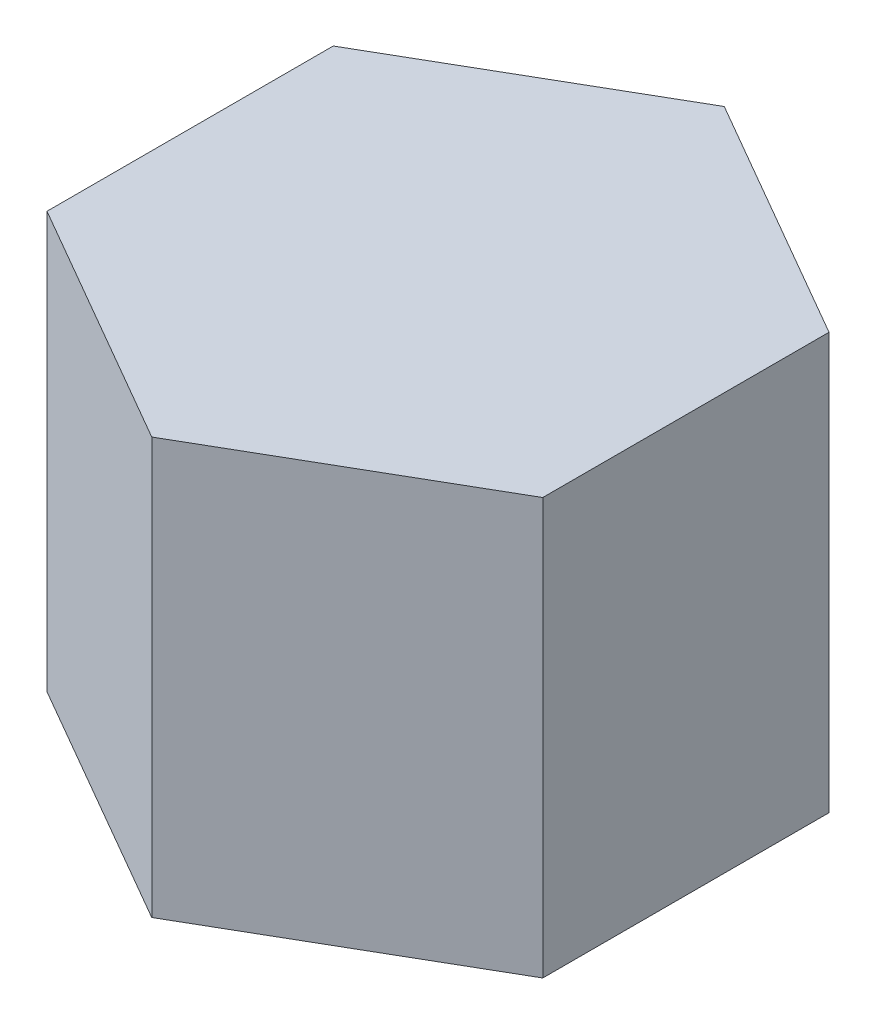
ISO-10303-21;
HEADER;
FILE_DESCRIPTION(('STEP AP214'),'2;1');
FILE_NAME('part.step','',(''),(''),'','','');
FILE_SCHEMA(('AUTOMOTIVE_DESIGN { 1 0 10303 214 1 1 1 1 }'));
ENDSEC;
DATA;
#1=APPLICATION_CONTEXT('core data for automotive mechanical design processes');
#2=APPLICATION_PROTOCOL_DEFINITION('international standard','automotive_design',2000,#1);
#3=PRODUCT_CONTEXT('',#1,'mechanical');
#4=PRODUCT('Part','Part','',(#3));
#5=PRODUCT_RELATED_PRODUCT_CATEGORY('part','',(#4));
#6=PRODUCT_DEFINITION_FORMATION('','',#4);
#7=PRODUCT_DEFINITION_CONTEXT('part definition',#1,'design');
#8=PRODUCT_DEFINITION('design','',#6,#7);
#9=PRODUCT_DEFINITION_SHAPE('','',#8);
#10=(LENGTH_UNIT() NAMED_UNIT(*) SI_UNIT(.MILLI.,.METRE.));
#11=(NAMED_UNIT(*) PLANE_ANGLE_UNIT() SI_UNIT($,.RADIAN.));
#12=(NAMED_UNIT(*) SI_UNIT($,.STERADIAN.) SOLID_ANGLE_UNIT());
#13=UNCERTAINTY_MEASURE_WITH_UNIT(LENGTH_MEASURE(1.E-05),#10,'distance_accuracy_value','');
#14=(GEOMETRIC_REPRESENTATION_CONTEXT(3) GLOBAL_UNCERTAINTY_ASSIGNED_CONTEXT((#13)) GLOBAL_UNIT_ASSIGNED_CONTEXT((#10,
#11,#12)) REPRESENTATION_CONTEXT('',''));
#15=CARTESIAN_POINT('',(0.,0.,0.));
#16=DIRECTION('',(0.,0.,1.));
#17=DIRECTION('',(1.,0.,0.));
#18=AXIS2_PLACEMENT_3D('',#15,#16,#17);
#19=CARTESIAN_POINT('',(205.339551417382,-147.556598747966,288.217869605357));
#20=DIRECTION('',(-0.499999999999943,0.,-0.866025403784471));
#21=DIRECTION('',(-0.866025403784471,0.,0.499999999999943));
#22=AXIS2_PLACEMENT_3D('',#19,#20,#21);
#23=PLANE('',#22);
#24=CARTESIAN_POINT('',(205.642660308706,-147.047793579175,288.042869605357));
#25=DIRECTION('',(-0.866025403784471,0.,0.499999999999943));
#26=VECTOR('',#25,1.);
#27=LINE('',#24,#26);
#28=CARTESIAN_POINT('',(205.642660308706,-147.047793579175,288.042869605357));
#29=VERTEX_POINT('',#28);
#30=CARTESIAN_POINT('',(205.339551417382,-147.047793579175,288.217869605357));
#31=VERTEX_POINT('',#30);
#32=EDGE_CURVE('E170',#29,#31,#27,.T.);
#33=ORIENTED_EDGE('',*,*,#32,.T.);
#34=CARTESIAN_POINT('',(205.339551417382,-147.556598747966,288.217869605357));
#35=DIRECTION('',(0.,1.,0.));
#36=VECTOR('',#35,1.);
#37=LINE('',#34,#36);
#38=CARTESIAN_POINT('',(205.339551417382,-147.556598747966,288.217869605357));
#39=VERTEX_POINT('',#38);
#40=EDGE_CURVE('E35',#39,#31,#37,.T.);
#41=ORIENTED_EDGE('',*,*,#40,.F.);
#42=CARTESIAN_POINT('',(205.642660308706,-147.556598747966,288.042869605357));
#43=DIRECTION('',(-0.866025403784471,0.,0.499999999999943));
#44=VECTOR('',#43,1.);
#45=LINE('',#42,#44);
#46=CARTESIAN_POINT('',(205.642660308706,-147.556598747966,288.042869605357));
#47=VERTEX_POINT('',#46);
#48=EDGE_CURVE('E159',#47,#39,#45,.T.);
#49=ORIENTED_EDGE('',*,*,#48,.F.);
#50=CARTESIAN_POINT('',(205.642660308706,-147.556598747966,288.042869605357));
#51=DIRECTION('',(0.,1.,0.));
#52=VECTOR('',#51,1.);
#53=LINE('',#50,#52);
#54=EDGE_CURVE('E10',#47,#29,#53,.T.);
#55=ORIENTED_EDGE('',*,*,#54,.T.);
#56=EDGE_LOOP('',(#33,#41,#49,#55));
#57=FACE_BOUND('',#56,.T.);
#58=ADVANCED_FACE('F16',(#57),#23,.F.);
#59=CARTESIAN_POINT('',(205.642660308706,-147.556598747966,291.594471220494));
#60=DIRECTION('',(-1.,0.,0.));
#61=DIRECTION('',(0.,-1.,0.));
#62=AXIS2_PLACEMENT_3D('',#59,#60,#61);
#63=PLANE('',#62);
#64=CARTESIAN_POINT('',(205.642660308706,-147.047793579175,287.692869605357));
#65=DIRECTION('',(0.,0.,1.));
#66=VECTOR('',#65,1.);
#67=LINE('',#64,#66);
#68=CARTESIAN_POINT('',(205.642660308706,-147.047793579175,287.692869605357));
#69=VERTEX_POINT('',#68);
#70=EDGE_CURVE('E167',#69,#29,#67,.T.);
#71=ORIENTED_EDGE('',*,*,#70,.T.);
#72=ORIENTED_EDGE('',*,*,#54,.F.);
#73=CARTESIAN_POINT('',(205.642660308706,-147.556598747966,287.692869605357));
#74=DIRECTION('',(0.,0.,1.));
#75=VECTOR('',#74,1.);
#76=LINE('',#73,#75);
#77=CARTESIAN_POINT('',(205.642660308706,-147.556598747966,287.692869605357));
#78=VERTEX_POINT('',#77);
#79=EDGE_CURVE('E156',#78,#47,#76,.T.);
#80=ORIENTED_EDGE('',*,*,#79,.F.);
#81=CARTESIAN_POINT('',(205.642660308706,-147.556598747966,287.692869605357));
#82=DIRECTION('',(0.,1.,0.));
#83=VECTOR('',#82,1.);
#84=LINE('',#81,#83);
#85=EDGE_CURVE('E27',#78,#69,#84,.T.);
#86=ORIENTED_EDGE('',*,*,#85,.T.);
#87=EDGE_LOOP('',(#71,#72,#80,#86));
#88=FACE_BOUND('',#87,.T.);
#89=ADVANCED_FACE('F189',(#88),#63,.F.);
#90=CARTESIAN_POINT('',(205.642660308706,-147.556598747966,287.692869605357));
#91=DIRECTION('',(-0.499999999999943,0.,0.866025403784471));
#92=DIRECTION('',(0.866025403784471,0.,0.499999999999943));
#93=AXIS2_PLACEMENT_3D('',#90,#91,#92);
#94=PLANE('',#93);
#95=CARTESIAN_POINT('',(205.339551417382,-147.047793579175,287.517869605357));
#96=DIRECTION('',(0.866025403784471,0.,0.499999999999943));
#97=VECTOR('',#96,1.);
#98=LINE('',#95,#97);
#99=CARTESIAN_POINT('',(205.339551417382,-147.047793579175,287.517869605357));
#100=VERTEX_POINT('',#99);
#101=EDGE_CURVE('E163',#100,#69,#98,.T.);
#102=ORIENTED_EDGE('',*,*,#101,.T.);
#103=ORIENTED_EDGE('',*,*,#85,.F.);
#104=CARTESIAN_POINT('',(205.339551417382,-147.556598747966,287.517869605357));
#105=DIRECTION('',(0.866025403784471,0.,0.499999999999943));
#106=VECTOR('',#105,1.);
#107=LINE('',#104,#106);
#108=CARTESIAN_POINT('',(205.339551417382,-147.556598747966,287.517869605357));
#109=VERTEX_POINT('',#108);
#110=EDGE_CURVE('E106',#109,#78,#107,.T.);
#111=ORIENTED_EDGE('',*,*,#110,.F.);
#112=CARTESIAN_POINT('',(205.339551417382,-147.556598747966,287.517869605357));
#113=DIRECTION('',(0.,1.,0.));
#114=VECTOR('',#113,1.);
#115=LINE('',#112,#114);
#116=EDGE_CURVE('E94',#109,#100,#115,.T.);
#117=ORIENTED_EDGE('',*,*,#116,.T.);
#118=EDGE_LOOP('',(#102,#103,#111,#117));
#119=FACE_BOUND('',#118,.T.);
#120=ADVANCED_FACE('F198',(#119),#94,.F.);
#121=CARTESIAN_POINT('',(205.339551417382,-147.556598747966,287.517869605357));
#122=DIRECTION('',(0.499999999999978,0.,0.866025403784452));
#123=DIRECTION('',(0.866025403784452,0.,-0.499999999999978));
#124=AXIS2_PLACEMENT_3D('',#121,#122,#123);
#125=PLANE('',#124);
#126=CARTESIAN_POINT('',(205.036442526057,-147.047793579175,287.692869605357));
#127=DIRECTION('',(0.866025403784452,0.,-0.499999999999978));
#128=VECTOR('',#127,1.);
#129=LINE('',#126,#128);
#130=CARTESIAN_POINT('',(205.036442526057,-147.047793579175,287.692869605357));
#131=VERTEX_POINT('',#130);
#132=EDGE_CURVE('E162',#131,#100,#129,.T.);
#133=ORIENTED_EDGE('',*,*,#132,.T.);
#134=ORIENTED_EDGE('',*,*,#116,.F.);
#135=CARTESIAN_POINT('',(205.036442526057,-147.556598747966,287.692869605357));
#136=DIRECTION('',(0.866025403784452,0.,-0.499999999999978));
#137=VECTOR('',#136,1.);
#138=LINE('',#135,#137);
#139=CARTESIAN_POINT('',(205.036442526057,-147.556598747966,287.692869605357));
#140=VERTEX_POINT('',#139);
#141=EDGE_CURVE('E98',#140,#109,#138,.T.);
#142=ORIENTED_EDGE('',*,*,#141,.F.);
#143=CARTESIAN_POINT('',(205.036442526057,-147.556598747966,287.692869605357));
#144=DIRECTION('',(0.,1.,0.));
#145=VECTOR('',#144,1.);
#146=LINE('',#143,#145);
#147=EDGE_CURVE('E79',#140,#131,#146,.T.);
#148=ORIENTED_EDGE('',*,*,#147,.T.);
#149=EDGE_LOOP('',(#133,#134,#142,#148));
#150=FACE_BOUND('',#149,.T.);
#151=ADVANCED_FACE('F100',(#150),#125,.F.);
#152=CARTESIAN_POINT('',(205.036442526057,-147.556598747966,291.594471220494));
#153=DIRECTION('',(1.,0.,0.));
#154=DIRECTION('',(0.,1.,0.));
#155=AXIS2_PLACEMENT_3D('',#152,#153,#154);
#156=PLANE('',#155);
#157=CARTESIAN_POINT('',(205.036442526057,-147.047793579175,288.042869605357));
#158=DIRECTION('',(0.,0.,-1.));
#159=VECTOR('',#158,1.);
#160=LINE('',#157,#159);
#161=CARTESIAN_POINT('',(205.036442526057,-147.047793579175,288.042869605357));
#162=VERTEX_POINT('',#161);
#163=EDGE_CURVE('E88',#162,#131,#160,.T.);
#164=ORIENTED_EDGE('',*,*,#163,.T.);
#165=ORIENTED_EDGE('',*,*,#147,.F.);
#166=CARTESIAN_POINT('',(205.036442526057,-147.556598747966,288.042869605357));
#167=DIRECTION('',(0.,0.,-1.));
#168=VECTOR('',#167,1.);
#169=LINE('',#166,#168);
#170=CARTESIAN_POINT('',(205.036442526057,-147.556598747966,288.042869605357));
#171=VERTEX_POINT('',#170);
#172=EDGE_CURVE('E84',#171,#140,#169,.T.);
#173=ORIENTED_EDGE('',*,*,#172,.F.);
#174=CARTESIAN_POINT('',(205.036442526057,-147.556598747966,288.042869605357));
#175=DIRECTION('',(0.,1.,0.));
#176=VECTOR('',#175,1.);
#177=LINE('',#174,#176);
#178=EDGE_CURVE('E58',#171,#162,#177,.T.);
#179=ORIENTED_EDGE('',*,*,#178,.T.);
#180=EDGE_LOOP('',(#164,#165,#173,#179));
#181=FACE_BOUND('',#180,.T.);
#182=ADVANCED_FACE('F82',(#181),#156,.F.);
#183=CARTESIAN_POINT('',(205.036442526057,-147.556598747966,288.042869605357));
#184=DIRECTION('',(0.499999999999943,0.,-0.866025403784471));
#185=DIRECTION('',(-0.866025403784471,0.,-0.499999999999943));
#186=AXIS2_PLACEMENT_3D('',#183,#184,#185);
#187=PLANE('',#186);
#188=CARTESIAN_POINT('',(205.339551417382,-147.047793579175,288.217869605357));
#189=DIRECTION('',(-0.866025403784471,0.,-0.499999999999943));
#190=VECTOR('',#189,1.);
#191=LINE('',#188,#190);
#192=EDGE_CURVE('E160',#31,#162,#191,.T.);
#193=ORIENTED_EDGE('',*,*,#192,.T.);
#194=ORIENTED_EDGE('',*,*,#178,.F.);
#195=CARTESIAN_POINT('',(205.339551417382,-147.556598747966,288.217869605357));
#196=DIRECTION('',(-0.866025403784471,0.,-0.499999999999943));
#197=VECTOR('',#196,1.);
#198=LINE('',#195,#197);
#199=EDGE_CURVE('E112',#39,#171,#198,.T.);
#200=ORIENTED_EDGE('',*,*,#199,.F.);
#201=ORIENTED_EDGE('',*,*,#40,.T.);
#202=EDGE_LOOP('',(#193,#194,#200,#201));
#203=FACE_BOUND('',#202,.T.);
#204=ADVANCED_FACE('F131',(#203),#187,.F.);
#205=CARTESIAN_POINT('',(206.491105863044,-147.556598747966,291.594471220494));
#206=DIRECTION('',(0.,1.,0.));
#207=DIRECTION('',(-1.,0.,0.));
#208=AXIS2_PLACEMENT_3D('',#205,#206,#207);
#209=PLANE('',#208);
#210=ORIENTED_EDGE('',*,*,#48,.T.);
#211=ORIENTED_EDGE('',*,*,#199,.T.);
#212=ORIENTED_EDGE('',*,*,#172,.T.);
#213=ORIENTED_EDGE('',*,*,#141,.T.);
#214=ORIENTED_EDGE('',*,*,#110,.T.);
#215=ORIENTED_EDGE('',*,*,#79,.T.);
#216=EDGE_LOOP('',(#210,#211,#212,#213,#214,#215));
#217=FACE_BOUND('',#216,.T.);
#218=ADVANCED_FACE('F111',(#217),#209,.F.);
#219=CARTESIAN_POINT('',(206.491105863044,-147.047793579175,291.594471220494));
#220=DIRECTION('',(0.,1.,0.));
#221=DIRECTION('',(-1.,0.,0.));
#222=AXIS2_PLACEMENT_3D('',#219,#220,#221);
#223=PLANE('',#222);
#224=ORIENTED_EDGE('',*,*,#32,.F.);
#225=ORIENTED_EDGE('',*,*,#70,.F.);
#226=ORIENTED_EDGE('',*,*,#101,.F.);
#227=ORIENTED_EDGE('',*,*,#132,.F.);
#228=ORIENTED_EDGE('',*,*,#163,.F.);
#229=ORIENTED_EDGE('',*,*,#192,.F.);
#230=EDGE_LOOP('',(#224,#225,#226,#227,#228,#229));
#231=FACE_BOUND('',#230,.T.);
#232=ADVANCED_FACE('F130',(#231),#223,.T.);
#233=CLOSED_SHELL('',(#58,#89,#120,#151,#182,#204,#218,#232));
#234=MANIFOLD_SOLID_BREP('B1',#233);
#235=ADVANCED_BREP_SHAPE_REPRESENTATION('',(#18,#234),#14);
#236=SHAPE_DEFINITION_REPRESENTATION(#9,#235);
ENDSEC;
END-ISO-10303-21;
